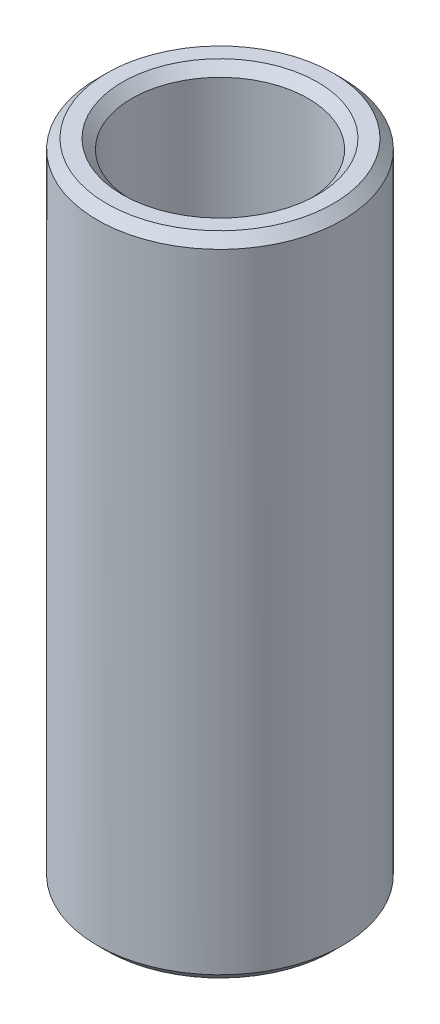
ISO-10303-21;
HEADER;
FILE_DESCRIPTION(('STEP AP214'),'2;1');
FILE_NAME('part.step','',(''),(''),'','','');
FILE_SCHEMA(('AUTOMOTIVE_DESIGN { 1 0 10303 214 1 1 1 1 }'));
ENDSEC;
DATA;
#1=APPLICATION_CONTEXT('core data for automotive mechanical design processes');
#2=APPLICATION_PROTOCOL_DEFINITION('international standard','automotive_design',2000,#1);
#3=PRODUCT_CONTEXT('',#1,'mechanical');
#4=PRODUCT('Part','Part','',(#3));
#5=PRODUCT_RELATED_PRODUCT_CATEGORY('part','',(#4));
#6=PRODUCT_DEFINITION_FORMATION('','',#4);
#7=PRODUCT_DEFINITION_CONTEXT('part definition',#1,'design');
#8=PRODUCT_DEFINITION('design','',#6,#7);
#9=PRODUCT_DEFINITION_SHAPE('','',#8);
#10=(LENGTH_UNIT() NAMED_UNIT(*) SI_UNIT(.MILLI.,.METRE.));
#11=(NAMED_UNIT(*) PLANE_ANGLE_UNIT() SI_UNIT($,.RADIAN.));
#12=(NAMED_UNIT(*) SI_UNIT($,.STERADIAN.) SOLID_ANGLE_UNIT());
#13=UNCERTAINTY_MEASURE_WITH_UNIT(LENGTH_MEASURE(1.E-05),#10,'distance_accuracy_value','');
#14=(GEOMETRIC_REPRESENTATION_CONTEXT(3) GLOBAL_UNCERTAINTY_ASSIGNED_CONTEXT((#13)) GLOBAL_UNIT_ASSIGNED_CONTEXT((#10,
#11,#12)) REPRESENTATION_CONTEXT('',''));
#15=CARTESIAN_POINT('',(0.,0.,0.));
#16=DIRECTION('',(0.,0.,1.));
#17=DIRECTION('',(1.,0.,0.));
#18=AXIS2_PLACEMENT_3D('',#15,#16,#17);
#19=CARTESIAN_POINT('',(0.,237.478988636347,0.));
#20=DIRECTION('',(0.,-1.,0.));
#21=DIRECTION('',(0.,0.,-1.));
#22=AXIS2_PLACEMENT_3D('',#19,#20,#21);
#23=CYLINDRICAL_SURFACE('',#22,45.);
#24=CARTESIAN_POINT('',(0.,3.46421092040267,0.));
#25=DIRECTION('',(0.,1.,0.));
#26=DIRECTION('',(0.,0.,1.));
#27=AXIS2_PLACEMENT_3D('',#24,#25,#26);
#28=CIRCLE('',#27,45.);
#29=CARTESIAN_POINT('',(0.,3.46421092040267,45.));
#30=VERTEX_POINT('',#29);
#31=EDGE_CURVE('E10',#30,#30,#28,.T.);
#32=ORIENTED_EDGE('',*,*,#31,.T.);
#33=EDGE_LOOP('',(#32));
#34=FACE_BOUND('',#33,.T.);
#35=CARTESIAN_POINT('',(0.,234.014777715945,0.));
#36=DIRECTION('',(0.,1.,0.));
#37=DIRECTION('',(0.,0.,1.));
#38=AXIS2_PLACEMENT_3D('',#35,#36,#37);
#39=CIRCLE('',#38,45.);
#40=CARTESIAN_POINT('',(0.,234.014777715945,-45.));
#41=VERTEX_POINT('',#40);
#42=EDGE_CURVE('E50',#41,#41,#39,.F.);
#43=ORIENTED_EDGE('',*,*,#42,.T.);
#44=EDGE_LOOP('',(#43));
#45=FACE_BOUND('',#44,.T.);
#46=ADVANCED_FACE('F39',(#34,#45),#23,.T.);
#47=CARTESIAN_POINT('',(0.,237.478988636347,0.));
#48=DIRECTION('',(0.,1.,0.));
#49=DIRECTION('',(0.,0.,1.));
#50=AXIS2_PLACEMENT_3D('',#47,#48,#49);
#51=PLANE('',#50);
#52=CARTESIAN_POINT('',(0.,237.478988636347,0.));
#53=DIRECTION('',(0.,1.,0.));
#54=DIRECTION('',(0.,0.,1.));
#55=AXIS2_PLACEMENT_3D('',#52,#53,#54);
#56=CIRCLE('',#55,35.8149184982699);
#57=CARTESIAN_POINT('',(0.,237.478988636347,35.8149184982699));
#58=VERTEX_POINT('',#57);
#59=EDGE_CURVE('E58',#58,#58,#56,.F.);
#60=ORIENTED_EDGE('',*,*,#59,.T.);
#61=EDGE_LOOP('',(#60));
#62=FACE_BOUND('',#61,.T.);
#63=CARTESIAN_POINT('',(0.,237.478988636347,0.));
#64=DIRECTION('',(0.,1.,0.));
#65=DIRECTION('',(0.,0.,1.));
#66=AXIS2_PLACEMENT_3D('',#63,#64,#65);
#67=CIRCLE('',#66,41.5357890795973);
#68=CARTESIAN_POINT('',(0.,237.478988636347,-41.5357890795973));
#69=VERTEX_POINT('',#68);
#70=EDGE_CURVE('E61',#69,#69,#67,.T.);
#71=ORIENTED_EDGE('',*,*,#70,.T.);
#72=EDGE_LOOP('',(#71));
#73=FACE_BOUND('',#72,.T.);
#74=ADVANCED_FACE('F88',(#62,#73),#51,.T.);
#75=CARTESIAN_POINT('',(0.,0.,0.));
#76=DIRECTION('',(0.,1.,0.));
#77=DIRECTION('',(0.,0.,1.));
#78=AXIS2_PLACEMENT_3D('',#75,#76,#77);
#79=PLANE('',#78);
#80=CARTESIAN_POINT('',(0.,0.,0.));
#81=DIRECTION('',(0.,1.,0.));
#82=DIRECTION('',(0.,0.,1.));
#83=AXIS2_PLACEMENT_3D('',#80,#81,#82);
#84=CIRCLE('',#83,35.8149184982699);
#85=CARTESIAN_POINT('',(0.,0.,35.8149184982699));
#86=VERTEX_POINT('',#85);
#87=EDGE_CURVE('E51',#86,#86,#84,.T.);
#88=ORIENTED_EDGE('',*,*,#87,.T.);
#89=EDGE_LOOP('',(#88));
#90=FACE_BOUND('',#89,.T.);
#91=CARTESIAN_POINT('',(0.,0.,0.));
#92=DIRECTION('',(0.,1.,0.));
#93=DIRECTION('',(0.,0.,1.));
#94=AXIS2_PLACEMENT_3D('',#91,#92,#93);
#95=CIRCLE('',#94,41.5357890795973);
#96=CARTESIAN_POINT('',(0.,0.,41.5357890795973));
#97=VERTEX_POINT('',#96);
#98=EDGE_CURVE('E54',#97,#97,#95,.F.);
#99=ORIENTED_EDGE('',*,*,#98,.T.);
#100=EDGE_LOOP('',(#99));
#101=FACE_BOUND('',#100,.T.);
#102=ADVANCED_FACE('F83',(#90,#101),#79,.F.);
#103=CARTESIAN_POINT('',(0.,237.478988636347,0.));
#104=DIRECTION('',(0.,-1.,0.));
#105=DIRECTION('',(0.,0.,-1.));
#106=AXIS2_PLACEMENT_3D('',#103,#104,#105);
#107=CYLINDRICAL_SURFACE('',#106,32.3507075778671);
#108=CARTESIAN_POINT('',(0.,234.014777715945,0.));
#109=DIRECTION('',(0.,1.,0.));
#110=DIRECTION('',(0.,0.,1.));
#111=AXIS2_PLACEMENT_3D('',#108,#109,#110);
#112=CIRCLE('',#111,32.3507075778671);
#113=CARTESIAN_POINT('',(0.,234.014777715945,32.3507075778671));
#114=VERTEX_POINT('',#113);
#115=EDGE_CURVE('E67',#114,#114,#112,.T.);
#116=ORIENTED_EDGE('',*,*,#115,.T.);
#117=EDGE_LOOP('',(#116));
#118=FACE_BOUND('',#117,.T.);
#119=CARTESIAN_POINT('',(0.,3.46421092040278,0.));
#120=DIRECTION('',(0.,1.,0.));
#121=DIRECTION('',(0.,0.,1.));
#122=AXIS2_PLACEMENT_3D('',#119,#120,#121);
#123=CIRCLE('',#122,32.3507075778671);
#124=CARTESIAN_POINT('',(0.,3.46421092040278,32.3507075778671));
#125=VERTEX_POINT('',#124);
#126=EDGE_CURVE('E69',#125,#125,#123,.F.);
#127=ORIENTED_EDGE('',*,*,#126,.T.);
#128=EDGE_LOOP('',(#127));
#129=FACE_BOUND('',#128,.T.);
#130=ADVANCED_FACE('F71',(#118,#129),#107,.F.);
#131=CARTESIAN_POINT('',(0.,234.014777715945,0.));
#132=DIRECTION('',(0.,1.,0.));
#133=DIRECTION('',(0.,0.,1.));
#134=AXIS2_PLACEMENT_3D('',#131,#132,#133);
#135=CONICAL_SURFACE('',#134,32.3507075778671,0.785398163397448);
#136=CARTESIAN_POINT('',(0.,237.478988636347,35.8149184982699));
#137=CARTESIAN_POINT('',(0.,237.442903105927,35.778832967849));
#138=CARTESIAN_POINT('',(0.,237.406817575506,35.7427474374281));
#139=CARTESIAN_POINT('',(0.,237.334646514664,35.6705763765864));
#140=CARTESIAN_POINT('',(0.,237.298560984243,35.6344908461656));
#141=CARTESIAN_POINT('',(0.,237.226389923401,35.5623197853238));
#142=CARTESIAN_POINT('',(0.,237.190304392981,35.526234254903));
#143=CARTESIAN_POINT('',(0.,237.118133332139,35.4540631940612));
#144=CARTESIAN_POINT('',(0.,237.082047801718,35.4179776636404));
#145=CARTESIAN_POINT('',(0.,237.009876740876,35.3458066027987));
#146=CARTESIAN_POINT('',(0.,236.973791210455,35.3097210723778));
#147=CARTESIAN_POINT('',(0.,236.901620149614,35.2375500115361));
#148=CARTESIAN_POINT('',(0.,236.865534619193,35.2014644811152));
#149=CARTESIAN_POINT('',(0.,236.793363558351,35.1292934202735));
#150=CARTESIAN_POINT('',(0.,236.75727802793,35.0932078898526));
#151=CARTESIAN_POINT('',(0.,236.685106967088,35.0210368290109));
#152=CARTESIAN_POINT('',(0.,236.649021436668,34.98495129859));
#153=CARTESIAN_POINT('',(0.,236.576850375826,34.9127802377483));
#154=CARTESIAN_POINT('',(0.,236.540764845405,34.8766947073275));
#155=CARTESIAN_POINT('',(0.,236.468593784563,34.8045236464857));
#156=CARTESIAN_POINT('',(0.,236.432508254142,34.7684381160649));
#157=CARTESIAN_POINT('',(0.,236.360337193301,34.6962670552231));
#158=CARTESIAN_POINT('',(0.,236.32425166288,34.6601815248023));
#159=CARTESIAN_POINT('',(0.,236.252080602038,34.5880104639606));
#160=CARTESIAN_POINT('',(0.,236.215995071617,34.5519249335397));
#161=CARTESIAN_POINT('',(0.,236.143824010776,34.479753872698));
#162=CARTESIAN_POINT('',(0.,236.107738480355,34.4436683422771));
#163=CARTESIAN_POINT('',(0.,236.035567419513,34.3714972814354));
#164=CARTESIAN_POINT('',(0.,235.999481889092,34.3354117510145));
#165=CARTESIAN_POINT('',(0.,235.92731082825,34.2632406901728));
#166=CARTESIAN_POINT('',(0.,235.891225297829,34.2271551597519));
#167=CARTESIAN_POINT('',(0.,235.819054236988,34.1549840989102));
#168=CARTESIAN_POINT('',(0.,235.782968706567,34.1188985684894));
#169=CARTESIAN_POINT('',(0.,235.710797645725,34.0467275076476));
#170=CARTESIAN_POINT('',(0.,235.674712115304,34.0106419772268));
#171=CARTESIAN_POINT('',(0.,235.602541054463,33.9384709163851));
#172=CARTESIAN_POINT('',(0.,235.566455524042,33.9023853859642));
#173=CARTESIAN_POINT('',(0.,235.4942844632,33.8302143251225));
#174=CARTESIAN_POINT('',(0.,235.458198932779,33.7941287947016));
#175=CARTESIAN_POINT('',(0.,235.386027871937,33.7219577338599));
#176=CARTESIAN_POINT('',(0.,235.349942341517,33.685872203439));
#177=CARTESIAN_POINT('',(0.,235.277771280675,33.6137011425973));
#178=CARTESIAN_POINT('',(0.,235.241685750254,33.5776156121764));
#179=CARTESIAN_POINT('',(0.,235.169514689412,33.5054445513347));
#180=CARTESIAN_POINT('',(0.,235.133429158991,33.4693590209138));
#181=CARTESIAN_POINT('',(0.,235.06125809815,33.3971879600721));
#182=CARTESIAN_POINT('',(0.,235.025172567729,33.3611024296513));
#183=CARTESIAN_POINT('',(0.,234.953001506887,33.2889313688095));
#184=CARTESIAN_POINT('',(0.,234.916915976466,33.2528458383887));
#185=CARTESIAN_POINT('',(0.,234.844744915624,33.180674777547));
#186=CARTESIAN_POINT('',(0.,234.808659385204,33.1445892471261));
#187=CARTESIAN_POINT('',(0.,234.736488324362,33.0724181862844));
#188=CARTESIAN_POINT('',(0.,234.700402793941,33.0363326558635));
#189=CARTESIAN_POINT('',(0.,234.628231733099,32.9641615950218));
#190=CARTESIAN_POINT('',(0.,234.592146202678,32.9280760646009));
#191=CARTESIAN_POINT('',(0.,234.519975141837,32.8559050037592));
#192=CARTESIAN_POINT('',(0.,234.483889611416,32.8198194733383));
#193=CARTESIAN_POINT('',(0.,234.411718550574,32.7476484124966));
#194=CARTESIAN_POINT('',(0.,234.375633020153,32.7115628820758));
#195=CARTESIAN_POINT('',(0.,234.303461959312,32.639391821234));
#196=CARTESIAN_POINT('',(0.,234.267376428891,32.6033062908132));
#197=CARTESIAN_POINT('',(0.,234.195205368049,32.5311352299714));
#198=CARTESIAN_POINT('',(0.,234.159119837628,32.4950496995506));
#199=CARTESIAN_POINT('',(0.,234.086948776786,32.4228786387089));
#200=CARTESIAN_POINT('',(0.,234.050863246366,32.386793108288));
#201=CARTESIAN_POINT('',(0.,234.014777715945,32.3507075778671));
#202=B_SPLINE_CURVE_WITH_KNOTS('',3,(#136,#137,#138,#139,#140,#141,#142,#143,#144,#145,#146,
#147,#148,#149,#150,#151,#152,#153,#154,#155,#156,#157,#158,#159,#160,#161,#162,#163,#164,#165,
#166,#167,#168,#169,#170,#171,#172,#173,#174,#175,#176,#177,#178,#179,#180,#181,#182,#183,#184,
#185,#186,#187,#188,#189,#190,#191,#192,#193,#194,#195,#196,#197,#198,#199,#200,#201),
.UNSPECIFIED.,.F.,.F.,(4,2,2,2,2,2,2,2,2,2,2,2,2,2,2,2,2,2,2,2,2,2,2,2,2,2,2,2,2,2,2,2,4),(0.,
0.153097939579814,0.306195879159652,0.459293818739471,0.612391758319304,0.765489697899138,
0.918587637478956,1.07168557705879,1.22478351663863,1.37788145621844,1.53097939579828,
1.6840773353781,1.83717527495793,1.99027321453777,2.14337115411758,2.29646909369742,
2.44956703327726,2.60266497285707,2.75576291243691,2.90886085201673,3.06195879159656,
3.21505673117639,3.36815467075621,3.52125261033605,3.67435054991588,3.8274484894957,
3.98054642907554,4.13364436865535,4.28674230823519,4.43984024781502,4.59293818739484,
4.74603612697468,4.89913406655449),.UNSPECIFIED.);
#203=EDGE_CURVE('BSEAM77',#58,#114,#202,.T.);
#204=ORIENTED_EDGE('',*,*,#59,.F.);
#205=ORIENTED_EDGE('',*,*,#115,.F.);
#206=ORIENTED_EDGE('',*,*,#203,.T.);
#207=ORIENTED_EDGE('',*,*,#203,.F.);
#208=EDGE_LOOP('',(#204,#206,#205,#207));
#209=FACE_BOUND('',#208,.T.);
#210=ADVANCED_FACE('F77',(#209),#135,.F.);
#211=CARTESIAN_POINT('',(0.,0.,0.));
#212=DIRECTION('',(0.,-1.,0.));
#213=DIRECTION('',(0.,0.,-1.));
#214=AXIS2_PLACEMENT_3D('',#211,#212,#213);
#215=CONICAL_SURFACE('',#214,35.8149184982699,0.785398163397444);
#216=ORIENTED_EDGE('',*,*,#126,.F.);
#217=EDGE_LOOP('',(#216));
#218=FACE_BOUND('',#217,.T.);
#219=ORIENTED_EDGE('',*,*,#87,.F.);
#220=EDGE_LOOP('',(#219));
#221=FACE_BOUND('',#220,.T.);
#222=ADVANCED_FACE('F73',(#218,#221),#215,.F.);
#223=CARTESIAN_POINT('',(0.,3.46421092040267,0.));
#224=DIRECTION('',(0.,1.,0.));
#225=DIRECTION('',(0.,0.,1.));
#226=AXIS2_PLACEMENT_3D('',#223,#224,#225);
#227=CONICAL_SURFACE('',#226,45.,0.785398163397456);
#228=ORIENTED_EDGE('',*,*,#98,.F.);
#229=EDGE_LOOP('',(#228));
#230=FACE_BOUND('',#229,.T.);
#231=ORIENTED_EDGE('',*,*,#31,.F.);
#232=EDGE_LOOP('',(#231));
#233=FACE_BOUND('',#232,.T.);
#234=ADVANCED_FACE('F76',(#230,#233),#227,.T.);
#235=CARTESIAN_POINT('',(0.,237.478988636347,0.));
#236=DIRECTION('',(0.,-1.,0.));
#237=DIRECTION('',(0.,0.,-1.));
#238=AXIS2_PLACEMENT_3D('',#235,#236,#237);
#239=CONICAL_SURFACE('',#238,41.5357890795973,0.785398163397451);
#240=CARTESIAN_POINT('',(0.,234.014777715945,-45.));
#241=CARTESIAN_POINT('',(0.,234.050863246366,-44.9639144695792));
#242=CARTESIAN_POINT('',(0.,234.086948776786,-44.9278289391583));
#243=CARTESIAN_POINT('',(0.,234.159119837628,-44.8556578783166));
#244=CARTESIAN_POINT('',(0.,234.195205368049,-44.8195723478957));
#245=CARTESIAN_POINT('',(0.,234.267376428891,-44.747401287054));
#246=CARTESIAN_POINT('',(0.,234.303461959312,-44.7113157566331));
#247=CARTESIAN_POINT('',(0.,234.375633020153,-44.6391446957914));
#248=CARTESIAN_POINT('',(0.,234.411718550574,-44.6030591653705));
#249=CARTESIAN_POINT('',(0.,234.483889611416,-44.5308881045288));
#250=CARTESIAN_POINT('',(0.,234.519975141837,-44.494802574108));
#251=CARTESIAN_POINT('',(0.,234.592146202678,-44.4226315132662));
#252=CARTESIAN_POINT('',(0.,234.628231733099,-44.3865459828454));
#253=CARTESIAN_POINT('',(0.,234.700402793941,-44.3143749220036));
#254=CARTESIAN_POINT('',(0.,234.736488324362,-44.2782893915828));
#255=CARTESIAN_POINT('',(0.,234.808659385204,-44.2061183307411));
#256=CARTESIAN_POINT('',(0.,234.844744915624,-44.1700328003202));
#257=CARTESIAN_POINT('',(0.,234.916915976466,-44.0978617394785));
#258=CARTESIAN_POINT('',(0.,234.953001506887,-44.0617762090576));
#259=CARTESIAN_POINT('',(0.,235.025172567729,-43.9896051482159));
#260=CARTESIAN_POINT('',(0.,235.06125809815,-43.953519617795));
#261=CARTESIAN_POINT('',(0.,235.133429158991,-43.8813485569533));
#262=CARTESIAN_POINT('',(0.,235.169514689412,-43.8452630265324));
#263=CARTESIAN_POINT('',(0.,235.241685750254,-43.7730919656907));
#264=CARTESIAN_POINT('',(0.,235.277771280675,-43.7370064352698));
#265=CARTESIAN_POINT('',(0.,235.349942341517,-43.6648353744281));
#266=CARTESIAN_POINT('',(0.,235.386027871937,-43.6287498440073));
#267=CARTESIAN_POINT('',(0.,235.458198932779,-43.5565787831655));
#268=CARTESIAN_POINT('',(0.,235.4942844632,-43.5204932527447));
#269=CARTESIAN_POINT('',(0.,235.566455524042,-43.448322191903));
#270=CARTESIAN_POINT('',(0.,235.602541054463,-43.4122366614821));
#271=CARTESIAN_POINT('',(0.,235.674712115304,-43.3400656006404));
#272=CARTESIAN_POINT('',(0.,235.710797645725,-43.3039800702195));
#273=CARTESIAN_POINT('',(0.,235.782968706567,-43.2318090093778));
#274=CARTESIAN_POINT('',(0.,235.819054236988,-43.1957234789569));
#275=CARTESIAN_POINT('',(0.,235.891225297829,-43.1235524181152));
#276=CARTESIAN_POINT('',(0.,235.92731082825,-43.0874668876943));
#277=CARTESIAN_POINT('',(0.,235.999481889092,-43.0152958268526));
#278=CARTESIAN_POINT('',(0.,236.035567419513,-42.9792102964318));
#279=CARTESIAN_POINT('',(0.,236.107738480355,-42.90703923559));
#280=CARTESIAN_POINT('',(0.,236.143824010776,-42.8709537051692));
#281=CARTESIAN_POINT('',(0.,236.215995071617,-42.7987826443274));
#282=CARTESIAN_POINT('',(0.,236.252080602038,-42.7626971139066));
#283=CARTESIAN_POINT('',(0.,236.32425166288,-42.6905260530649));
#284=CARTESIAN_POINT('',(0.,236.360337193301,-42.654440522644));
#285=CARTESIAN_POINT('',(0.,236.432508254142,-42.5822694618023));
#286=CARTESIAN_POINT('',(0.,236.468593784563,-42.5461839313814));
#287=CARTESIAN_POINT('',(0.,236.540764845405,-42.4740128705397));
#288=CARTESIAN_POINT('',(0.,236.576850375826,-42.4379273401188));
#289=CARTESIAN_POINT('',(0.,236.649021436668,-42.3657562792771));
#290=CARTESIAN_POINT('',(0.,236.685106967088,-42.3296707488562));
#291=CARTESIAN_POINT('',(0.,236.75727802793,-42.2574996880145));
#292=CARTESIAN_POINT('',(0.,236.793363558351,-42.2214141575937));
#293=CARTESIAN_POINT('',(0.,236.865534619193,-42.1492430967519));
#294=CARTESIAN_POINT('',(0.,236.901620149614,-42.1131575663311));
#295=CARTESIAN_POINT('',(0.,236.973791210455,-42.0409865054893));
#296=CARTESIAN_POINT('',(0.,237.009876740876,-42.0049009750685));
#297=CARTESIAN_POINT('',(0.,237.082047801718,-41.9327299142268));
#298=CARTESIAN_POINT('',(0.,237.118133332139,-41.8966443838059));
#299=CARTESIAN_POINT('',(0.,237.190304392981,-41.8244733229642));
#300=CARTESIAN_POINT('',(0.,237.226389923401,-41.7883877925433));
#301=CARTESIAN_POINT('',(0.,237.298560984243,-41.7162167317016));
#302=CARTESIAN_POINT('',(0.,237.334646514664,-41.6801312012807));
#303=CARTESIAN_POINT('',(0.,237.406817575506,-41.607960140439));
#304=CARTESIAN_POINT('',(0.,237.442903105927,-41.5718746100181));
#305=CARTESIAN_POINT('',(0.,237.478988636347,-41.5357890795973));
#306=B_SPLINE_CURVE_WITH_KNOTS('',3,(#240,#241,#242,#243,#244,#245,#246,#247,#248,#249,#250,
#251,#252,#253,#254,#255,#256,#257,#258,#259,#260,#261,#262,#263,#264,#265,#266,#267,#268,#269,
#270,#271,#272,#273,#274,#275,#276,#277,#278,#279,#280,#281,#282,#283,#284,#285,#286,#287,#288,
#289,#290,#291,#292,#293,#294,#295,#296,#297,#298,#299,#300,#301,#302,#303,#304,#305),
.UNSPECIFIED.,.F.,.F.,(4,2,2,2,2,2,2,2,2,2,2,2,2,2,2,2,2,2,2,2,2,2,2,2,2,2,2,2,2,2,2,2,4),(0.,
0.153097939579833,0.306195879159672,0.45929381873949,0.612391758319324,0.765489697899162,
0.918587637478976,1.07168557705881,1.22478351663863,1.37788145621847,1.5309793957983,
1.68407733537812,1.83717527495796,1.9902732145378,2.14337115411761,2.29646909369745,
2.44956703327726,2.6026649728571,2.75576291243694,2.90886085201675,3.06195879159659,
3.21505673117642,3.36815467075624,3.52125261033608,3.67435054991591,3.82744848949573,
3.98054642907557,4.13364436865538,4.28674230823522,4.43984024781506,4.59293818739487,
4.74603612697471,4.89913406655455),.UNSPECIFIED.);
#307=EDGE_CURVE('BSEAM45',#41,#69,#306,.T.);
#308=ORIENTED_EDGE('',*,*,#42,.F.);
#309=ORIENTED_EDGE('',*,*,#70,.F.);
#310=ORIENTED_EDGE('',*,*,#307,.T.);
#311=ORIENTED_EDGE('',*,*,#307,.F.);
#312=EDGE_LOOP('',(#308,#310,#309,#311));
#313=FACE_BOUND('',#312,.T.);
#314=ADVANCED_FACE('F45',(#313),#239,.T.);
#315=CLOSED_SHELL('',(#46,#74,#102,#130,#210,#222,#234,#314));
#316=MANIFOLD_SOLID_BREP('B2',#315);
#317=ADVANCED_BREP_SHAPE_REPRESENTATION('',(#18,#316),#14);
#318=SHAPE_DEFINITION_REPRESENTATION(#9,#317);
ENDSEC;
END-ISO-10303-21;
